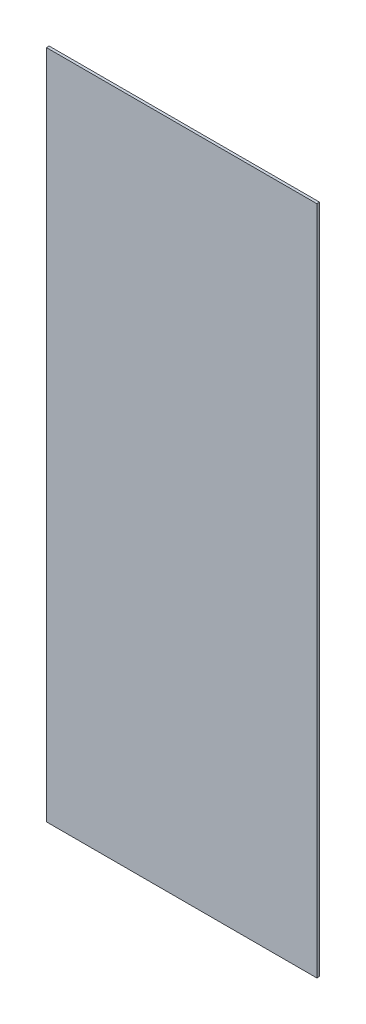
ISO-10303-21;
HEADER;
FILE_DESCRIPTION(('STEP AP214'),'2;1');
FILE_NAME('part.step','',(''),(''),'','','');
FILE_SCHEMA(('AUTOMOTIVE_DESIGN { 1 0 10303 214 1 1 1 1 }'));
ENDSEC;
DATA;
#1=APPLICATION_CONTEXT('core data for automotive mechanical design processes');
#2=APPLICATION_PROTOCOL_DEFINITION('international standard','automotive_design',2000,#1);
#3=PRODUCT_CONTEXT('',#1,'mechanical');
#4=PRODUCT('Part','Part','',(#3));
#5=PRODUCT_RELATED_PRODUCT_CATEGORY('part','',(#4));
#6=PRODUCT_DEFINITION_FORMATION('','',#4);
#7=PRODUCT_DEFINITION_CONTEXT('part definition',#1,'design');
#8=PRODUCT_DEFINITION('design','',#6,#7);
#9=PRODUCT_DEFINITION_SHAPE('','',#8);
#10=(LENGTH_UNIT() NAMED_UNIT(*) SI_UNIT(.MILLI.,.METRE.));
#11=(NAMED_UNIT(*) PLANE_ANGLE_UNIT() SI_UNIT($,.RADIAN.));
#12=(NAMED_UNIT(*) SI_UNIT($,.STERADIAN.) SOLID_ANGLE_UNIT());
#13=UNCERTAINTY_MEASURE_WITH_UNIT(LENGTH_MEASURE(1.E-05),#10,'distance_accuracy_value','');
#14=(GEOMETRIC_REPRESENTATION_CONTEXT(3) GLOBAL_UNCERTAINTY_ASSIGNED_CONTEXT((#13)) GLOBAL_UNIT_ASSIGNED_CONTEXT((#10,
#11,#12)) REPRESENTATION_CONTEXT('',''));
#15=CARTESIAN_POINT('',(0.,0.,0.));
#16=DIRECTION('',(0.,0.,1.));
#17=DIRECTION('',(1.,0.,0.));
#18=AXIS2_PLACEMENT_3D('',#15,#16,#17);
#19=CARTESIAN_POINT('',(-100.,248.,2.));
#20=DIRECTION('',(1.,0.,0.));
#21=DIRECTION('',(0.,1.,0.));
#22=AXIS2_PLACEMENT_3D('',#19,#20,#21);
#23=PLANE('',#22);
#24=DIRECTION('',(0.,-1.,0.));
#25=VECTOR('',#24,1.);
#26=CARTESIAN_POINT('',(-100.,248.,0.));
#27=LINE('',#26,#25);
#28=CARTESIAN_POINT('',(-100.,248.,0.));
#29=VERTEX_POINT('',#28);
#30=CARTESIAN_POINT('',(-100.,-248.,0.));
#31=VERTEX_POINT('',#30);
#32=EDGE_CURVE('E97',#29,#31,#27,.T.);
#33=ORIENTED_EDGE('',*,*,#32,.T.);
#34=DIRECTION('',(0.,0.,-1.));
#35=VECTOR('',#34,1.);
#36=CARTESIAN_POINT('',(-100.,-248.,2.));
#37=LINE('',#36,#35);
#38=CARTESIAN_POINT('',(-100.,-248.,2.));
#39=VERTEX_POINT('',#38);
#40=EDGE_CURVE('E11',#39,#31,#37,.T.);
#41=ORIENTED_EDGE('',*,*,#40,.F.);
#42=DIRECTION('',(0.,-1.,0.));
#43=VECTOR('',#42,1.);
#44=CARTESIAN_POINT('',(-100.,248.,2.));
#45=LINE('',#44,#43);
#46=CARTESIAN_POINT('',(-100.,248.,2.));
#47=VERTEX_POINT('',#46);
#48=EDGE_CURVE('E85',#47,#39,#45,.T.);
#49=ORIENTED_EDGE('',*,*,#48,.F.);
#50=DIRECTION('',(0.,0.,-1.));
#51=VECTOR('',#50,1.);
#52=CARTESIAN_POINT('',(-100.,248.,2.));
#53=LINE('',#52,#51);
#54=EDGE_CURVE('E93',#47,#29,#53,.T.);
#55=ORIENTED_EDGE('',*,*,#54,.T.);
#56=EDGE_LOOP('',(#33,#41,#49,#55));
#57=FACE_BOUND('',#56,.T.);
#58=ADVANCED_FACE('F34',(#57),#23,.F.);
#59=CARTESIAN_POINT('',(100.,-248.,2.));
#60=DIRECTION('',(0.,1.,0.));
#61=DIRECTION('',(0.,0.,1.));
#62=AXIS2_PLACEMENT_3D('',#59,#60,#61);
#63=PLANE('',#62);
#64=DIRECTION('',(1.,0.,0.));
#65=VECTOR('',#64,1.);
#66=CARTESIAN_POINT('',(100.,-248.,0.));
#67=LINE('',#66,#65);
#68=CARTESIAN_POINT('',(100.,-248.,0.));
#69=VERTEX_POINT('',#68);
#70=EDGE_CURVE('E89',#31,#69,#67,.T.);
#71=ORIENTED_EDGE('',*,*,#70,.T.);
#72=DIRECTION('',(0.,0.,-1.));
#73=VECTOR('',#72,1.);
#74=CARTESIAN_POINT('',(100.,-248.,2.));
#75=LINE('',#74,#73);
#76=CARTESIAN_POINT('',(100.,-248.,2.));
#77=VERTEX_POINT('',#76);
#78=EDGE_CURVE('E42',#77,#69,#75,.T.);
#79=ORIENTED_EDGE('',*,*,#78,.F.);
#80=DIRECTION('',(1.,0.,0.));
#81=VECTOR('',#80,1.);
#82=CARTESIAN_POINT('',(100.,-248.,2.));
#83=LINE('',#82,#81);
#84=EDGE_CURVE('E80',#39,#77,#83,.T.);
#85=ORIENTED_EDGE('',*,*,#84,.F.);
#86=ORIENTED_EDGE('',*,*,#40,.T.);
#87=EDGE_LOOP('',(#71,#79,#85,#86));
#88=FACE_BOUND('',#87,.T.);
#89=ADVANCED_FACE('F88',(#88),#63,.F.);
#90=CARTESIAN_POINT('',(100.,248.,2.));
#91=DIRECTION('',(-1.,0.,0.));
#92=DIRECTION('',(0.,-1.,0.));
#93=AXIS2_PLACEMENT_3D('',#90,#91,#92);
#94=PLANE('',#93);
#95=DIRECTION('',(0.,1.,0.));
#96=VECTOR('',#95,1.);
#97=CARTESIAN_POINT('',(100.,248.,0.));
#98=LINE('',#97,#96);
#99=CARTESIAN_POINT('',(100.,248.,0.));
#100=VERTEX_POINT('',#99);
#101=EDGE_CURVE('E67',#69,#100,#98,.T.);
#102=ORIENTED_EDGE('',*,*,#101,.T.);
#103=DIRECTION('',(0.,0.,-1.));
#104=VECTOR('',#103,1.);
#105=CARTESIAN_POINT('',(100.,248.,2.));
#106=LINE('',#105,#104);
#107=CARTESIAN_POINT('',(100.,248.,2.));
#108=VERTEX_POINT('',#107);
#109=EDGE_CURVE('E90',#108,#100,#106,.T.);
#110=ORIENTED_EDGE('',*,*,#109,.F.);
#111=DIRECTION('',(0.,1.,0.));
#112=VECTOR('',#111,1.);
#113=CARTESIAN_POINT('',(100.,248.,2.));
#114=LINE('',#113,#112);
#115=EDGE_CURVE('E83',#77,#108,#114,.T.);
#116=ORIENTED_EDGE('',*,*,#115,.F.);
#117=ORIENTED_EDGE('',*,*,#78,.T.);
#118=EDGE_LOOP('',(#102,#110,#116,#117));
#119=FACE_BOUND('',#118,.T.);
#120=ADVANCED_FACE('F91',(#119),#94,.F.);
#121=CARTESIAN_POINT('',(100.,248.,2.));
#122=DIRECTION('',(0.,-1.,0.));
#123=DIRECTION('',(1.,0.,0.));
#124=AXIS2_PLACEMENT_3D('',#121,#122,#123);
#125=PLANE('',#124);
#126=DIRECTION('',(-1.,0.,0.));
#127=VECTOR('',#126,1.);
#128=CARTESIAN_POINT('',(100.,248.,0.));
#129=LINE('',#128,#127);
#130=EDGE_CURVE('E73',#100,#29,#129,.T.);
#131=ORIENTED_EDGE('',*,*,#130,.T.);
#132=ORIENTED_EDGE('',*,*,#54,.F.);
#133=DIRECTION('',(-1.,0.,0.));
#134=VECTOR('',#133,1.);
#135=CARTESIAN_POINT('',(100.,248.,2.));
#136=LINE('',#135,#134);
#137=EDGE_CURVE('E50',#108,#47,#136,.T.);
#138=ORIENTED_EDGE('',*,*,#137,.F.);
#139=ORIENTED_EDGE('',*,*,#109,.T.);
#140=EDGE_LOOP('',(#131,#132,#138,#139));
#141=FACE_BOUND('',#140,.T.);
#142=ADVANCED_FACE('F104',(#141),#125,.F.);
#143=CARTESIAN_POINT('',(0.,0.,2.));
#144=DIRECTION('',(0.,0.,-1.));
#145=DIRECTION('',(-1.,0.,0.));
#146=AXIS2_PLACEMENT_3D('',#143,#144,#145);
#147=PLANE('',#146);
#148=ORIENTED_EDGE('',*,*,#48,.T.);
#149=ORIENTED_EDGE('',*,*,#84,.T.);
#150=ORIENTED_EDGE('',*,*,#115,.T.);
#151=ORIENTED_EDGE('',*,*,#137,.T.);
#152=EDGE_LOOP('',(#148,#149,#150,#151));
#153=FACE_BOUND('',#152,.T.);
#154=ADVANCED_FACE('F81',(#153),#147,.F.);
#155=CARTESIAN_POINT('',(0.,0.,0.));
#156=DIRECTION('',(0.,0.,-1.));
#157=DIRECTION('',(-1.,0.,0.));
#158=AXIS2_PLACEMENT_3D('',#155,#156,#157);
#159=PLANE('',#158);
#160=ORIENTED_EDGE('',*,*,#32,.F.);
#161=ORIENTED_EDGE('',*,*,#130,.F.);
#162=ORIENTED_EDGE('',*,*,#101,.F.);
#163=ORIENTED_EDGE('',*,*,#70,.F.);
#164=EDGE_LOOP('',(#160,#161,#162,#163));
#165=FACE_BOUND('',#164,.T.);
#166=ADVANCED_FACE('F107',(#165),#159,.T.);
#167=CLOSED_SHELL('',(#58,#89,#120,#142,#154,#166));
#168=MANIFOLD_SOLID_BREP('B2',#167);
#169=ADVANCED_BREP_SHAPE_REPRESENTATION('',(#18,#168),#14);
#170=SHAPE_DEFINITION_REPRESENTATION(#9,#169);
ENDSEC;
END-ISO-10303-21;
